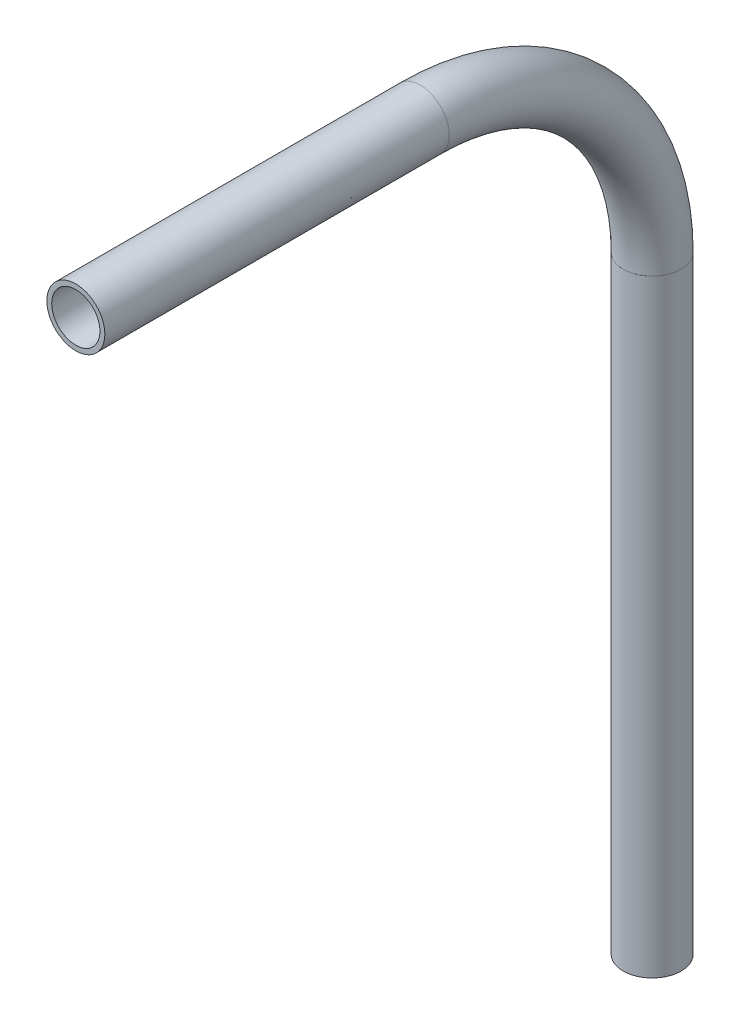
ISO-10303-21;
HEADER;
FILE_DESCRIPTION(('STEP AP214'),'2;1');
FILE_NAME('part.step','',(''),(''),'','','');
FILE_SCHEMA(('AUTOMOTIVE_DESIGN { 1 0 10303 214 1 1 1 1 }'));
ENDSEC;
DATA;
#1=APPLICATION_CONTEXT('core data for automotive mechanical design processes');
#2=APPLICATION_PROTOCOL_DEFINITION('international standard','automotive_design',2000,#1);
#3=PRODUCT_CONTEXT('',#1,'mechanical');
#4=PRODUCT('Part','Part','',(#3));
#5=PRODUCT_RELATED_PRODUCT_CATEGORY('part','',(#4));
#6=PRODUCT_DEFINITION_FORMATION('','',#4);
#7=PRODUCT_DEFINITION_CONTEXT('part definition',#1,'design');
#8=PRODUCT_DEFINITION('design','',#6,#7);
#9=PRODUCT_DEFINITION_SHAPE('','',#8);
#10=(LENGTH_UNIT() NAMED_UNIT(*) SI_UNIT(.MILLI.,.METRE.));
#11=(NAMED_UNIT(*) PLANE_ANGLE_UNIT() SI_UNIT($,.RADIAN.));
#12=(NAMED_UNIT(*) SI_UNIT($,.STERADIAN.) SOLID_ANGLE_UNIT());
#13=UNCERTAINTY_MEASURE_WITH_UNIT(LENGTH_MEASURE(1.E-05),#10,'distance_accuracy_value','');
#14=(GEOMETRIC_REPRESENTATION_CONTEXT(3) GLOBAL_UNCERTAINTY_ASSIGNED_CONTEXT((#13)) GLOBAL_UNIT_ASSIGNED_CONTEXT((#10,
#11,#12)) REPRESENTATION_CONTEXT('',''));
#15=CARTESIAN_POINT('',(0.,0.,0.));
#16=DIRECTION('',(0.,0.,1.));
#17=DIRECTION('',(1.,0.,0.));
#18=AXIS2_PLACEMENT_3D('',#15,#16,#17);
#19=CARTESIAN_POINT('',(0.,1142.88067849817,310.1301173335));
#20=DIRECTION('',(0.,-1.,0.));
#21=DIRECTION('',(0.,0.,-1.));
#22=AXIS2_PLACEMENT_3D('',#19,#20,#21);
#23=CYLINDRICAL_SURFACE('',#22,5.28319999999999);
#24=CARTESIAN_POINT('',(0.,1009.74779894958,310.1301173335));
#25=DIRECTION('',(0.,1.,0.));
#26=DIRECTION('',(0.,0.,1.));
#27=AXIS2_PLACEMENT_3D('',#24,#25,#26);
#28=CIRCLE('',#27,5.28319999999999);
#29=CARTESIAN_POINT('',(0.,1009.74779894958,315.4133173335));
#30=VERTEX_POINT('',#29);
#31=EDGE_CURVE('E55',#30,#30,#28,.T.);
#32=ORIENTED_EDGE('',*,*,#31,.F.);
#33=EDGE_LOOP('',(#32));
#34=FACE_BOUND('',#33,.T.);
#35=CARTESIAN_POINT('',(0.,1142.88067849817,310.1301173335));
#36=DIRECTION('',(0.,1.,0.));
#37=DIRECTION('',(0.,0.,1.));
#38=AXIS2_PLACEMENT_3D('',#35,#36,#37);
#39=CIRCLE('',#38,5.28319999999999);
#40=CARTESIAN_POINT('',(0.,1142.88067849817,315.4133173335));
#41=VERTEX_POINT('',#40);
#42=EDGE_CURVE('E51',#41,#41,#39,.T.);
#43=ORIENTED_EDGE('',*,*,#42,.T.);
#44=EDGE_LOOP('',(#43));
#45=FACE_BOUND('',#44,.T.);
#46=ADVANCED_FACE('F47',(#34,#45),#23,.F.);
#47=CARTESIAN_POINT('',(0.,1142.88067849817,310.1301173335));
#48=DIRECTION('',(0.,-1.,0.));
#49=DIRECTION('',(0.,0.,-1.));
#50=AXIS2_PLACEMENT_3D('',#47,#48,#49);
#51=CYLINDRICAL_SURFACE('',#50,6.35);
#52=CARTESIAN_POINT('',(0.,1009.74779894958,310.1301173335));
#53=DIRECTION('',(0.,1.,0.));
#54=DIRECTION('',(0.,0.,1.));
#55=AXIS2_PLACEMENT_3D('',#52,#53,#54);
#56=CIRCLE('',#55,6.35);
#57=CARTESIAN_POINT('',(0.,1009.74779894958,316.4801173335));
#58=VERTEX_POINT('',#57);
#59=EDGE_CURVE('E59',#58,#58,#56,.T.);
#60=ORIENTED_EDGE('',*,*,#59,.T.);
#61=EDGE_LOOP('',(#60));
#62=FACE_BOUND('',#61,.T.);
#63=CARTESIAN_POINT('',(0.,1142.88067849817,310.1301173335));
#64=DIRECTION('',(0.,1.,0.));
#65=DIRECTION('',(0.,0.,1.));
#66=AXIS2_PLACEMENT_3D('',#63,#64,#65);
#67=CIRCLE('',#66,6.35);
#68=CARTESIAN_POINT('',(0.,1142.88067849817,316.4801173335));
#69=VERTEX_POINT('',#68);
#70=EDGE_CURVE('E12',#69,#69,#67,.T.);
#71=ORIENTED_EDGE('',*,*,#70,.F.);
#72=EDGE_LOOP('',(#71));
#73=FACE_BOUND('',#72,.T.);
#74=ADVANCED_FACE('F74',(#62,#73),#51,.T.);
#75=CARTESIAN_POINT('',(0.,1009.74779894958,310.1301173335));
#76=DIRECTION('',(0.,1.,0.));
#77=DIRECTION('',(0.,0.,1.));
#78=AXIS2_PLACEMENT_3D('',#75,#76,#77);
#79=PLANE('',#78);
#80=ORIENTED_EDGE('',*,*,#31,.T.);
#81=EDGE_LOOP('',(#80));
#82=FACE_BOUND('',#81,.T.);
#83=ORIENTED_EDGE('',*,*,#59,.F.);
#84=EDGE_LOOP('',(#83));
#85=FACE_BOUND('',#84,.T.);
#86=ADVANCED_FACE('F70',(#82,#85),#79,.F.);
#87=CARTESIAN_POINT('',(0.,1142.88067849817,310.1301173335));
#88=DIRECTION('',(0.,1.,0.));
#89=DIRECTION('',(0.,0.,1.));
#90=AXIS2_PLACEMENT_3D('',#87,#88,#89);
#91=PLANE('',#90);
#92=ORIENTED_EDGE('',*,*,#42,.F.);
#93=EDGE_LOOP('',(#92));
#94=FACE_BOUND('',#93,.T.);
#95=ORIENTED_EDGE('',*,*,#70,.T.);
#96=EDGE_LOOP('',(#95));
#97=FACE_BOUND('',#96,.T.);
#98=ADVANCED_FACE('F49',(#94,#97),#91,.T.);
#99=CLOSED_SHELL('',(#46,#74,#86,#98));
#100=MANIFOLD_SOLID_BREP('B2',#99);
#101=CARTESIAN_POINT('',(0.,1142.88067849817,360.9301173335));
#102=DIRECTION('',(-1.,0.,0.));
#103=DIRECTION('',(0.,0.,1.));
#104=AXIS2_PLACEMENT_3D('',#101,#102,#103);
#105=TOROIDAL_SURFACE('',#104,50.8,5.28319999999999);
#106=CARTESIAN_POINT('',(0.,1193.68067849817,360.9301173335));
#107=DIRECTION('',(0.,0.,1.));
#108=DIRECTION('',(0.,-1.,0.));
#109=AXIS2_PLACEMENT_3D('',#106,#107,#108);
#110=CIRCLE('',#109,5.28319999999999);
#111=CARTESIAN_POINT('',(0.,1198.96387849817,360.9301173335));
#112=VERTEX_POINT('',#111);
#113=EDGE_CURVE('E150',#112,#112,#110,.T.);
#114=CARTESIAN_POINT('',(0.,1142.88067849817,310.1301173335));
#115=DIRECTION('',(0.,-1.,0.));
#116=DIRECTION('',(0.,0.,-1.));
#117=AXIS2_PLACEMENT_3D('',#114,#115,#116);
#118=CIRCLE('',#117,5.28319999999999);
#119=CARTESIAN_POINT('',(0.,1142.88067849817,304.8469173335));
#120=VERTEX_POINT('',#119);
#121=EDGE_CURVE('E140',#120,#120,#118,.T.);
#122=CARTESIAN_POINT('',(0.,1142.88067849817,360.9301173335));
#123=DIRECTION('',(-1.,0.,0.));
#124=DIRECTION('',(0.,0.,1.));
#125=AXIS2_PLACEMENT_3D('',#122,#123,#124);
#126=CIRCLE('',#125,56.0831999999999);
#127=EDGE_CURVE('',#112,#120,#126,.T.);
#128=ORIENTED_EDGE('',*,*,#113,.T.);
#129=ORIENTED_EDGE('',*,*,#121,.T.);
#130=ORIENTED_EDGE('',*,*,#127,.T.);
#131=ORIENTED_EDGE('',*,*,#127,.F.);
#132=EDGE_LOOP('',(#128,#130,#129,#131));
#133=FACE_BOUND('',#132,.T.);
#134=ADVANCED_FACE('F136',(#133),#105,.F.);
#135=CARTESIAN_POINT('',(0.,1142.88067849817,360.9301173335));
#136=DIRECTION('',(-1.,0.,0.));
#137=DIRECTION('',(0.,0.,1.));
#138=AXIS2_PLACEMENT_3D('',#135,#136,#137);
#139=TOROIDAL_SURFACE('',#138,50.8,6.35);
#140=CARTESIAN_POINT('',(0.,1193.68067849817,360.9301173335));
#141=DIRECTION('',(0.,0.,1.));
#142=DIRECTION('',(0.,-1.,0.));
#143=AXIS2_PLACEMENT_3D('',#140,#141,#142);
#144=CIRCLE('',#143,6.35);
#145=CARTESIAN_POINT('',(0.,1200.03067849817,360.9301173335));
#146=VERTEX_POINT('',#145);
#147=EDGE_CURVE('E144',#146,#146,#144,.T.);
#148=CARTESIAN_POINT('',(0.,1142.88067849817,310.1301173335));
#149=DIRECTION('',(0.,-1.,0.));
#150=DIRECTION('',(0.,0.,-1.));
#151=AXIS2_PLACEMENT_3D('',#148,#149,#150);
#152=CIRCLE('',#151,6.35);
#153=CARTESIAN_POINT('',(0.,1142.88067849817,303.7801173335));
#154=VERTEX_POINT('',#153);
#155=EDGE_CURVE('E46',#154,#154,#152,.T.);
#156=CARTESIAN_POINT('',(0.,1142.88067849817,360.9301173335));
#157=DIRECTION('',(-1.,0.,0.));
#158=DIRECTION('',(0.,0.,1.));
#159=AXIS2_PLACEMENT_3D('',#156,#157,#158);
#160=CIRCLE('',#159,57.1499999999999);
#161=EDGE_CURVE('',#146,#154,#160,.T.);
#162=ORIENTED_EDGE('',*,*,#147,.F.);
#163=ORIENTED_EDGE('',*,*,#155,.F.);
#164=ORIENTED_EDGE('',*,*,#161,.T.);
#165=ORIENTED_EDGE('',*,*,#161,.F.);
#166=EDGE_LOOP('',(#162,#164,#163,#165));
#167=FACE_BOUND('',#166,.T.);
#168=ADVANCED_FACE('F163',(#167),#139,.T.);
#169=CARTESIAN_POINT('',(0.,1193.68067849817,360.9301173335));
#170=DIRECTION('',(0.,0.,1.));
#171=DIRECTION('',(0.,-1.,0.));
#172=AXIS2_PLACEMENT_3D('',#169,#170,#171);
#173=PLANE('',#172);
#174=ORIENTED_EDGE('',*,*,#113,.F.);
#175=EDGE_LOOP('',(#174));
#176=FACE_BOUND('',#175,.T.);
#177=ORIENTED_EDGE('',*,*,#147,.T.);
#178=EDGE_LOOP('',(#177));
#179=FACE_BOUND('',#178,.T.);
#180=ADVANCED_FACE('F159',(#176,#179),#173,.T.);
#181=CARTESIAN_POINT('',(0.,1142.88067849817,310.1301173335));
#182=DIRECTION('',(0.,-1.,0.));
#183=DIRECTION('',(0.,0.,-1.));
#184=AXIS2_PLACEMENT_3D('',#181,#182,#183);
#185=PLANE('',#184);
#186=ORIENTED_EDGE('',*,*,#121,.F.);
#187=EDGE_LOOP('',(#186));
#188=FACE_BOUND('',#187,.T.);
#189=ORIENTED_EDGE('',*,*,#155,.T.);
#190=EDGE_LOOP('',(#189));
#191=FACE_BOUND('',#190,.T.);
#192=ADVANCED_FACE('F138',(#188,#191),#185,.T.);
#193=CLOSED_SHELL('',(#134,#168,#180,#192));
#194=MANIFOLD_SOLID_BREP('B7',#193);
#195=CARTESIAN_POINT('',(0.,1193.68067849817,436.364979605686));
#196=DIRECTION('',(0.,0.,-1.));
#197=DIRECTION('',(-1.,0.,0.));
#198=AXIS2_PLACEMENT_3D('',#195,#196,#197);
#199=CYLINDRICAL_SURFACE('',#198,5.28319999999999);
#200=CARTESIAN_POINT('',(0.,1193.68067849817,436.364979605686));
#201=DIRECTION('',(0.,0.,1.));
#202=DIRECTION('',(0.,-1.,0.));
#203=AXIS2_PLACEMENT_3D('',#200,#201,#202);
#204=CIRCLE('',#203,5.28319999999999);
#205=CARTESIAN_POINT('',(0.,1188.39747849817,436.364979605686));
#206=VERTEX_POINT('',#205);
#207=EDGE_CURVE('E234',#206,#206,#204,.T.);
#208=ORIENTED_EDGE('',*,*,#207,.T.);
#209=EDGE_LOOP('',(#208));
#210=FACE_BOUND('',#209,.T.);
#211=CARTESIAN_POINT('',(0.,1193.68067849817,360.9301173335));
#212=DIRECTION('',(0.,0.,-1.));
#213=DIRECTION('',(0.,1.,0.));
#214=AXIS2_PLACEMENT_3D('',#211,#212,#213);
#215=CIRCLE('',#214,5.28319999999999);
#216=CARTESIAN_POINT('',(0.,1198.96387849817,360.9301173335));
#217=VERTEX_POINT('',#216);
#218=EDGE_CURVE('E224',#217,#217,#215,.T.);
#219=ORIENTED_EDGE('',*,*,#218,.T.);
#220=EDGE_LOOP('',(#219));
#221=FACE_BOUND('',#220,.T.);
#222=ADVANCED_FACE('F220',(#210,#221),#199,.F.);
#223=CARTESIAN_POINT('',(0.,1193.68067849817,436.364979605686));
#224=DIRECTION('',(0.,0.,-1.));
#225=DIRECTION('',(-1.,0.,0.));
#226=AXIS2_PLACEMENT_3D('',#223,#224,#225);
#227=CYLINDRICAL_SURFACE('',#226,6.35);
#228=CARTESIAN_POINT('',(0.,1193.68067849817,436.364979605686));
#229=DIRECTION('',(0.,0.,1.));
#230=DIRECTION('',(0.,-1.,0.));
#231=AXIS2_PLACEMENT_3D('',#228,#229,#230);
#232=CIRCLE('',#231,6.35);
#233=CARTESIAN_POINT('',(0.,1187.33067849817,436.364979605686));
#234=VERTEX_POINT('',#233);
#235=EDGE_CURVE('E228',#234,#234,#232,.T.);
#236=ORIENTED_EDGE('',*,*,#235,.F.);
#237=EDGE_LOOP('',(#236));
#238=FACE_BOUND('',#237,.T.);
#239=CARTESIAN_POINT('',(0.,1193.68067849817,360.9301173335));
#240=DIRECTION('',(0.,0.,-1.));
#241=DIRECTION('',(0.,1.,0.));
#242=AXIS2_PLACEMENT_3D('',#239,#240,#241);
#243=CIRCLE('',#242,6.35);
#244=CARTESIAN_POINT('',(0.,1200.03067849817,360.9301173335));
#245=VERTEX_POINT('',#244);
#246=EDGE_CURVE('E135',#245,#245,#243,.T.);
#247=ORIENTED_EDGE('',*,*,#246,.F.);
#248=EDGE_LOOP('',(#247));
#249=FACE_BOUND('',#248,.T.);
#250=ADVANCED_FACE('F247',(#238,#249),#227,.T.);
#251=CARTESIAN_POINT('',(0.,1193.68067849817,436.364979605686));
#252=DIRECTION('',(0.,0.,1.));
#253=DIRECTION('',(0.,-1.,0.));
#254=AXIS2_PLACEMENT_3D('',#251,#252,#253);
#255=PLANE('',#254);
#256=ORIENTED_EDGE('',*,*,#207,.F.);
#257=EDGE_LOOP('',(#256));
#258=FACE_BOUND('',#257,.T.);
#259=ORIENTED_EDGE('',*,*,#235,.T.);
#260=EDGE_LOOP('',(#259));
#261=FACE_BOUND('',#260,.T.);
#262=ADVANCED_FACE('F243',(#258,#261),#255,.T.);
#263=CARTESIAN_POINT('',(0.,1193.68067849817,360.9301173335));
#264=DIRECTION('',(0.,0.,-1.));
#265=DIRECTION('',(0.,1.,0.));
#266=AXIS2_PLACEMENT_3D('',#263,#264,#265);
#267=PLANE('',#266);
#268=ORIENTED_EDGE('',*,*,#218,.F.);
#269=EDGE_LOOP('',(#268));
#270=FACE_BOUND('',#269,.T.);
#271=ORIENTED_EDGE('',*,*,#246,.T.);
#272=EDGE_LOOP('',(#271));
#273=FACE_BOUND('',#272,.T.);
#274=ADVANCED_FACE('F222',(#270,#273),#267,.T.);
#275=CLOSED_SHELL('',(#222,#250,#262,#274));
#276=MANIFOLD_SOLID_BREP('B41',#275);
#277=ADVANCED_BREP_SHAPE_REPRESENTATION('',(#18,#100,#194,#276),#14);
#278=SHAPE_DEFINITION_REPRESENTATION(#9,#277);
ENDSEC;
END-ISO-10303-21;
